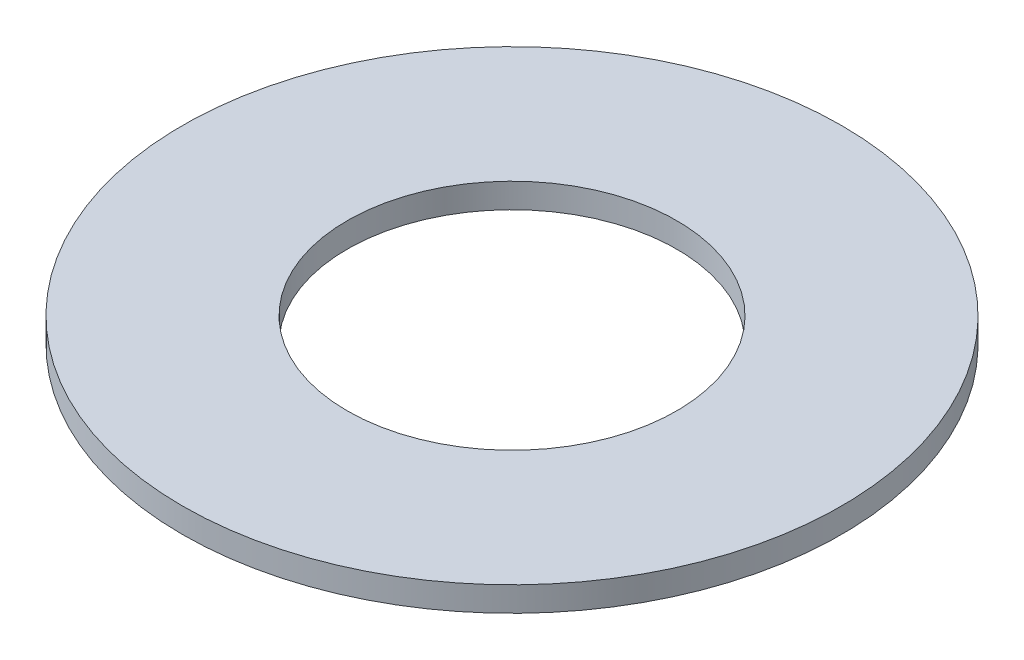
ISO-10303-21;
HEADER;
FILE_DESCRIPTION(('STEP AP214'),'2;1');
FILE_NAME('part.step','',(''),(''),'','','');
FILE_SCHEMA(('AUTOMOTIVE_DESIGN { 1 0 10303 214 1 1 1 1 }'));
ENDSEC;
DATA;
#1=APPLICATION_CONTEXT('core data for automotive mechanical design processes');
#2=APPLICATION_PROTOCOL_DEFINITION('international standard','automotive_design',2000,#1);
#3=PRODUCT_CONTEXT('',#1,'mechanical');
#4=PRODUCT('Part','Part','',(#3));
#5=PRODUCT_RELATED_PRODUCT_CATEGORY('part','',(#4));
#6=PRODUCT_DEFINITION_FORMATION('','',#4);
#7=PRODUCT_DEFINITION_CONTEXT('part definition',#1,'design');
#8=PRODUCT_DEFINITION('design','',#6,#7);
#9=PRODUCT_DEFINITION_SHAPE('','',#8);
#10=(LENGTH_UNIT() NAMED_UNIT(*) SI_UNIT(.MILLI.,.METRE.));
#11=(NAMED_UNIT(*) PLANE_ANGLE_UNIT() SI_UNIT($,.RADIAN.));
#12=(NAMED_UNIT(*) SI_UNIT($,.STERADIAN.) SOLID_ANGLE_UNIT());
#13=UNCERTAINTY_MEASURE_WITH_UNIT(LENGTH_MEASURE(1.E-05),#10,'distance_accuracy_value','');
#14=(GEOMETRIC_REPRESENTATION_CONTEXT(3) GLOBAL_UNCERTAINTY_ASSIGNED_CONTEXT((#13)) GLOBAL_UNIT_ASSIGNED_CONTEXT((#10,
#11,#12)) REPRESENTATION_CONTEXT('',''));
#15=CARTESIAN_POINT('',(0.,0.,0.));
#16=DIRECTION('',(0.,0.,1.));
#17=DIRECTION('',(1.,0.,0.));
#18=AXIS2_PLACEMENT_3D('',#15,#16,#17);
#19=CARTESIAN_POINT('',(0.,0.3,0.));
#20=DIRECTION('',(0.,-1.,0.));
#21=DIRECTION('',(0.,0.,-1.));
#22=AXIS2_PLACEMENT_3D('',#19,#20,#21);
#23=CYLINDRICAL_SURFACE('',#22,4.);
#24=CARTESIAN_POINT('',(0.,0.3,0.));
#25=DIRECTION('',(0.,1.,0.));
#26=DIRECTION('',(0.,0.,1.));
#27=AXIS2_PLACEMENT_3D('',#24,#25,#26);
#28=CIRCLE('',#27,4.);
#29=CARTESIAN_POINT('',(0.,0.3,4.));
#30=VERTEX_POINT('',#29);
#31=EDGE_CURVE('E10',#30,#30,#28,.T.);
#32=ORIENTED_EDGE('',*,*,#31,.F.);
#33=EDGE_LOOP('',(#32));
#34=FACE_BOUND('',#33,.T.);
#35=CARTESIAN_POINT('',(0.,0.,0.));
#36=DIRECTION('',(0.,1.,0.));
#37=DIRECTION('',(0.,0.,1.));
#38=AXIS2_PLACEMENT_3D('',#35,#36,#37);
#39=CIRCLE('',#38,4.);
#40=CARTESIAN_POINT('',(0.,0.,4.));
#41=VERTEX_POINT('',#40);
#42=EDGE_CURVE('E18',#41,#41,#39,.T.);
#43=ORIENTED_EDGE('',*,*,#42,.T.);
#44=EDGE_LOOP('',(#43));
#45=FACE_BOUND('',#44,.T.);
#46=ADVANCED_FACE('F15',(#34,#45),#23,.T.);
#47=CARTESIAN_POINT('',(0.,0.3,0.));
#48=DIRECTION('',(0.,1.,0.));
#49=DIRECTION('',(0.,0.,1.));
#50=AXIS2_PLACEMENT_3D('',#47,#48,#49);
#51=PLANE('',#50);
#52=CARTESIAN_POINT('',(0.,0.3,0.));
#53=DIRECTION('',(0.,1.,0.));
#54=DIRECTION('',(0.,0.,1.));
#55=AXIS2_PLACEMENT_3D('',#52,#53,#54);
#56=CIRCLE('',#55,2.);
#57=CARTESIAN_POINT('',(0.,0.3,2.));
#58=VERTEX_POINT('',#57);
#59=EDGE_CURVE('E27',#58,#58,#56,.T.);
#60=ORIENTED_EDGE('',*,*,#59,.F.);
#61=EDGE_LOOP('',(#60));
#62=FACE_BOUND('',#61,.T.);
#63=ORIENTED_EDGE('',*,*,#31,.T.);
#64=EDGE_LOOP('',(#63));
#65=FACE_BOUND('',#64,.T.);
#66=ADVANCED_FACE('F42',(#62,#65),#51,.T.);
#67=CARTESIAN_POINT('',(0.,0.,0.));
#68=DIRECTION('',(0.,1.,0.));
#69=DIRECTION('',(0.,0.,1.));
#70=AXIS2_PLACEMENT_3D('',#67,#68,#69);
#71=PLANE('',#70);
#72=CARTESIAN_POINT('',(0.,0.,0.));
#73=DIRECTION('',(0.,1.,0.));
#74=DIRECTION('',(0.,0.,1.));
#75=AXIS2_PLACEMENT_3D('',#72,#73,#74);
#76=CIRCLE('',#75,2.);
#77=CARTESIAN_POINT('',(0.,0.,2.));
#78=VERTEX_POINT('',#77);
#79=EDGE_CURVE('E25',#78,#78,#76,.T.);
#80=ORIENTED_EDGE('',*,*,#79,.T.);
#81=EDGE_LOOP('',(#80));
#82=FACE_BOUND('',#81,.T.);
#83=ORIENTED_EDGE('',*,*,#42,.F.);
#84=EDGE_LOOP('',(#83));
#85=FACE_BOUND('',#84,.T.);
#86=ADVANCED_FACE('F33',(#82,#85),#71,.F.);
#87=CARTESIAN_POINT('',(0.,0.,0.));
#88=DIRECTION('',(0.,1.,0.));
#89=DIRECTION('',(0.,0.,1.));
#90=AXIS2_PLACEMENT_3D('',#87,#88,#89);
#91=CYLINDRICAL_SURFACE('',#90,2.);
#92=ORIENTED_EDGE('',*,*,#79,.F.);
#93=EDGE_LOOP('',(#92));
#94=FACE_BOUND('',#93,.T.);
#95=ORIENTED_EDGE('',*,*,#59,.T.);
#96=EDGE_LOOP('',(#95));
#97=FACE_BOUND('',#96,.T.);
#98=ADVANCED_FACE('F36',(#94,#97),#91,.F.);
#99=CLOSED_SHELL('',(#46,#66,#86,#98));
#100=MANIFOLD_SOLID_BREP('B1',#99);
#101=ADVANCED_BREP_SHAPE_REPRESENTATION('',(#18,#100),#14);
#102=SHAPE_DEFINITION_REPRESENTATION(#9,#101);
ENDSEC;
END-ISO-10303-21;
